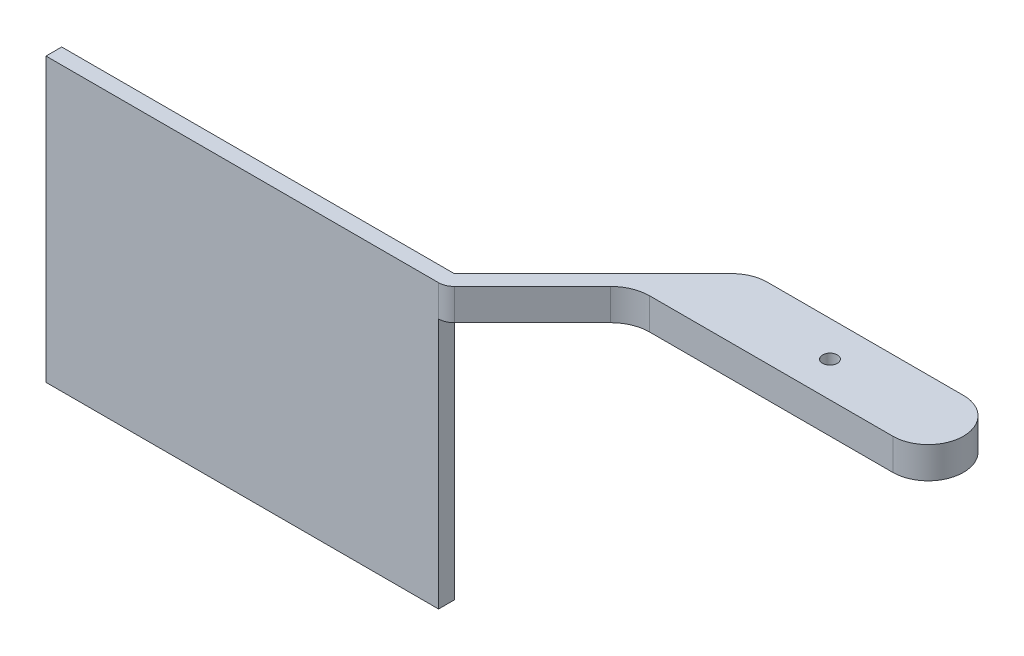
ISO-10303-21;
HEADER;
FILE_DESCRIPTION(('STEP AP214'),'2;1');
FILE_NAME('part.step','',(''),(''),'','','');
FILE_SCHEMA(('AUTOMOTIVE_DESIGN { 1 0 10303 214 1 1 1 1 }'));
ENDSEC;
DATA;
#1=APPLICATION_CONTEXT('core data for automotive mechanical design processes');
#2=APPLICATION_PROTOCOL_DEFINITION('international standard','automotive_design',2000,#1);
#3=PRODUCT_CONTEXT('',#1,'mechanical');
#4=PRODUCT('Part','Part','',(#3));
#5=PRODUCT_RELATED_PRODUCT_CATEGORY('part','',(#4));
#6=PRODUCT_DEFINITION_FORMATION('','',#4);
#7=PRODUCT_DEFINITION_CONTEXT('part definition',#1,'design');
#8=PRODUCT_DEFINITION('design','',#6,#7);
#9=PRODUCT_DEFINITION_SHAPE('','',#8);
#10=(LENGTH_UNIT() NAMED_UNIT(*) SI_UNIT(.MILLI.,.METRE.));
#11=(NAMED_UNIT(*) PLANE_ANGLE_UNIT() SI_UNIT($,.RADIAN.));
#12=(NAMED_UNIT(*) SI_UNIT($,.STERADIAN.) SOLID_ANGLE_UNIT());
#13=UNCERTAINTY_MEASURE_WITH_UNIT(LENGTH_MEASURE(1.E-05),#10,'distance_accuracy_value','');
#14=(GEOMETRIC_REPRESENTATION_CONTEXT(3) GLOBAL_UNCERTAINTY_ASSIGNED_CONTEXT((#13)) GLOBAL_UNIT_ASSIGNED_CONTEXT((#10,
#11,#12)) REPRESENTATION_CONTEXT('',''));
#15=CARTESIAN_POINT('',(0.,0.,0.));
#16=DIRECTION('',(0.,0.,1.));
#17=DIRECTION('',(1.,0.,0.));
#18=AXIS2_PLACEMENT_3D('',#15,#16,#17);
#19=CARTESIAN_POINT('',(0.,-4.,0.));
#20=DIRECTION('',(0.,1.,0.));
#21=DIRECTION('',(0.,0.,1.));
#22=AXIS2_PLACEMENT_3D('',#19,#20,#21);
#23=PLANE('',#22);
#24=DIRECTION('',(-0.707106781186547,0.,0.707106781186548));
#25=VECTOR('',#24,1.);
#26=CARTESIAN_POINT('',(-8.01776695296638,-4.,-8.01776695296637));
#27=LINE('',#26,#25);
#28=CARTESIAN_POINT('',(-22.,-4.,5.96446609406728));
#29=VERTEX_POINT('',#28);
#30=CARTESIAN_POINT('',(-31.9454364826301,-4.,15.9099025766974));
#31=VERTEX_POINT('',#30);
#32=EDGE_CURVE('E275',#29,#31,#27,.T.);
#33=ORIENTED_EDGE('',*,*,#32,.T.);
#34=CARTESIAN_POINT('',(-33.3596500450032,-4.,14.4956890143243));
#35=DIRECTION('',(0.,1.,0.));
#36=DIRECTION('',(0.,0.,1.));
#37=AXIS2_PLACEMENT_3D('',#34,#35,#36);
#38=CIRCLE('',#37,2.);
#39=CARTESIAN_POINT('',(-33.3596500450031,-4.,16.4956890143243));
#40=VERTEX_POINT('',#39);
#41=EDGE_CURVE('E11',#31,#40,#38,.F.);
#42=ORIENTED_EDGE('',*,*,#41,.T.);
#43=DIRECTION('',(0.,0.,1.));
#44=VECTOR('',#43,1.);
#45=CARTESIAN_POINT('',(-33.3596500450031,-4.,14.4956890143243));
#46=LINE('',#45,#44);
#47=CARTESIAN_POINT('',(-33.3596500450031,-4.,14.4956890143243));
#48=VERTEX_POINT('',#47);
#49=EDGE_CURVE('E224',#48,#40,#46,.T.);
#50=ORIENTED_EDGE('',*,*,#49,.F.);
#51=DIRECTION('',(-0.707106781186547,0.,0.707106781186548));
#52=VECTOR('',#51,1.);
#53=CARTESIAN_POINT('',(-9.43198051533949,-4.,-9.43198051533946));
#54=LINE('',#53,#52);
#55=CARTESIAN_POINT('',(-15.6819805153395,-4.,-3.18198051533944));
#56=VERTEX_POINT('',#55);
#57=EDGE_CURVE('E271',#56,#48,#54,.T.);
#58=ORIENTED_EDGE('',*,*,#57,.F.);
#59=CARTESIAN_POINT('',(-12.5,-4.,0.));
#60=DIRECTION('',(0.,1.,0.));
#61=DIRECTION('',(0.,0.,1.));
#62=AXIS2_PLACEMENT_3D('',#59,#60,#61);
#63=CIRCLE('',#62,4.5);
#64=CARTESIAN_POINT('',(-12.5,-4.,-4.5));
#65=VERTEX_POINT('',#64);
#66=EDGE_CURVE('E267',#65,#56,#63,.T.);
#67=ORIENTED_EDGE('',*,*,#66,.F.);
#68=DIRECTION('',(1.,0.,0.));
#69=VECTOR('',#68,1.);
#70=CARTESIAN_POINT('',(0.,-4.,-4.5));
#71=LINE('',#70,#69);
#72=CARTESIAN_POINT('',(12.5,-4.,-4.5));
#73=VERTEX_POINT('',#72);
#74=EDGE_CURVE('E264',#65,#73,#71,.T.);
#75=ORIENTED_EDGE('',*,*,#74,.T.);
#76=CARTESIAN_POINT('',(12.5,-4.,0.));
#77=DIRECTION('',(0.,1.,0.));
#78=DIRECTION('',(0.,0.,1.));
#79=AXIS2_PLACEMENT_3D('',#76,#77,#78);
#80=CIRCLE('',#79,4.5);
#81=CARTESIAN_POINT('',(12.5,-4.,4.49999999999999));
#82=VERTEX_POINT('',#81);
#83=EDGE_CURVE('E260',#82,#73,#80,.T.);
#84=ORIENTED_EDGE('',*,*,#83,.F.);
#85=DIRECTION('',(-1.,0.,0.));
#86=VECTOR('',#85,1.);
#87=CARTESIAN_POINT('',(0.,-4.,4.49999999999998));
#88=LINE('',#87,#86);
#89=CARTESIAN_POINT('',(-18.4644660940672,-4.,4.5));
#90=VERTEX_POINT('',#89);
#91=EDGE_CURVE('E256',#82,#90,#88,.T.);
#92=ORIENTED_EDGE('',*,*,#91,.T.);
#93=CARTESIAN_POINT('',(-18.4644660940672,-4.,9.5));
#94=DIRECTION('',(0.,1.,0.));
#95=DIRECTION('',(0.,0.,1.));
#96=AXIS2_PLACEMENT_3D('',#93,#94,#95);
#97=CIRCLE('',#96,5.);
#98=EDGE_CURVE('E252',#90,#29,#97,.T.);
#99=ORIENTED_EDGE('',*,*,#98,.T.);
#100=EDGE_LOOP('',(#33,#42,#50,#58,#67,#75,#84,#92,#99));
#101=FACE_BOUND('',#100,.T.);
#102=CARTESIAN_POINT('',(-14.05,-4.,0.));
#103=DIRECTION('',(0.,1.,0.));
#104=DIRECTION('',(0.,0.,1.));
#105=AXIS2_PLACEMENT_3D('',#102,#103,#104);
#106=CIRCLE('',#105,2.);
#107=CARTESIAN_POINT('',(-14.05,-4.,-2.));
#108=VERTEX_POINT('',#107);
#109=CARTESIAN_POINT('',(-14.05,-4.,2.));
#110=VERTEX_POINT('',#109);
#111=EDGE_CURVE('E776',#108,#110,#106,.T.);
#112=ORIENTED_EDGE('',*,*,#111,.T.);
#113=DIRECTION('',(0.99849670199507,0.,0.0548118244995302));
#114=VECTOR('',#113,1.);
#115=CARTESIAN_POINT('',(-14.05,-4.,2.));
#116=LINE('',#115,#114);
#117=CARTESIAN_POINT('',(-2.20907220343745,-4.,2.65));
#118=VERTEX_POINT('',#117);
#119=EDGE_CURVE('E206',#110,#118,#116,.T.);
#120=ORIENTED_EDGE('',*,*,#119,.T.);
#121=CARTESIAN_POINT('',(0.,-4.,0.));
#122=DIRECTION('',(0.,1.,0.));
#123=DIRECTION('',(0.,0.,1.));
#124=AXIS2_PLACEMENT_3D('',#121,#122,#123);
#125=CIRCLE('',#124,3.45);
#126=CARTESIAN_POINT('',(2.20907220343746,-4.,2.65));
#127=VERTEX_POINT('',#126);
#128=EDGE_CURVE('E769',#118,#127,#125,.T.);
#129=ORIENTED_EDGE('',*,*,#128,.T.);
#130=DIRECTION('',(0.998496701995071,0.,-0.0548118244995299));
#131=VECTOR('',#130,1.);
#132=CARTESIAN_POINT('',(14.05,-4.,2.));
#133=LINE('',#132,#131);
#134=CARTESIAN_POINT('',(14.05,-4.,2.));
#135=VERTEX_POINT('',#134);
#136=EDGE_CURVE('E745',#127,#135,#133,.T.);
#137=ORIENTED_EDGE('',*,*,#136,.T.);
#138=CARTESIAN_POINT('',(14.05,-4.,0.));
#139=DIRECTION('',(0.,1.,0.));
#140=DIRECTION('',(0.,0.,-1.));
#141=AXIS2_PLACEMENT_3D('',#138,#139,#140);
#142=CIRCLE('',#141,2.);
#143=CARTESIAN_POINT('',(14.05,-4.,-2.));
#144=VERTEX_POINT('',#143);
#145=EDGE_CURVE('E739',#135,#144,#142,.T.);
#146=ORIENTED_EDGE('',*,*,#145,.T.);
#147=DIRECTION('',(-0.998496701995071,0.,-0.05481182449953));
#148=VECTOR('',#147,1.);
#149=CARTESIAN_POINT('',(14.05,-4.,-2.));
#150=LINE('',#149,#148);
#151=CARTESIAN_POINT('',(2.20907220343746,-4.,-2.65));
#152=VERTEX_POINT('',#151);
#153=EDGE_CURVE('E733',#144,#152,#150,.T.);
#154=ORIENTED_EDGE('',*,*,#153,.T.);
#155=CARTESIAN_POINT('',(0.,-4.,0.));
#156=DIRECTION('',(0.,1.,0.));
#157=DIRECTION('',(0.,0.,1.));
#158=AXIS2_PLACEMENT_3D('',#155,#156,#157);
#159=CIRCLE('',#158,3.45);
#160=CARTESIAN_POINT('',(-2.20907220343745,-4.,-2.65));
#161=VERTEX_POINT('',#160);
#162=EDGE_CURVE('E724',#152,#161,#159,.T.);
#163=ORIENTED_EDGE('',*,*,#162,.T.);
#164=DIRECTION('',(-0.99849670199507,0.,0.0548118244995302));
#165=VECTOR('',#164,1.);
#166=CARTESIAN_POINT('',(-14.05,-4.,-2.));
#167=LINE('',#166,#165);
#168=EDGE_CURVE('E202',#161,#108,#167,.T.);
#169=ORIENTED_EDGE('',*,*,#168,.T.);
#170=EDGE_LOOP('',(#112,#120,#129,#137,#146,#154,#163,#169));
#171=FACE_BOUND('',#170,.T.);
#172=ADVANCED_FACE('F44',(#101,#171),#23,.F.);
#173=CARTESIAN_POINT('',(-18.4644660940672,-4.,9.5));
#174=DIRECTION('',(0.,1.,0.));
#175=DIRECTION('',(0.,0.,1.));
#176=AXIS2_PLACEMENT_3D('',#173,#174,#175);
#177=CYLINDRICAL_SURFACE('',#176,5.);
#178=CARTESIAN_POINT('',(-18.4644660940672,0.,9.5));
#179=DIRECTION('',(0.,1.,0.));
#180=DIRECTION('',(0.,0.,1.));
#181=AXIS2_PLACEMENT_3D('',#178,#179,#180);
#182=CIRCLE('',#181,5.);
#183=CARTESIAN_POINT('',(-18.4644660940672,0.,4.5));
#184=VERTEX_POINT('',#183);
#185=CARTESIAN_POINT('',(-22.,0.,5.96446609406728));
#186=VERTEX_POINT('',#185);
#187=EDGE_CURVE('E251',#184,#186,#182,.T.);
#188=ORIENTED_EDGE('',*,*,#187,.T.);
#189=DIRECTION('',(0.,1.,0.));
#190=VECTOR('',#189,1.);
#191=CARTESIAN_POINT('',(-22.,-4.,5.96446609406728));
#192=LINE('',#191,#190);
#193=EDGE_CURVE('E314',#29,#186,#192,.T.);
#194=ORIENTED_EDGE('',*,*,#193,.F.);
#195=ORIENTED_EDGE('',*,*,#98,.F.);
#196=DIRECTION('',(0.,1.,0.));
#197=VECTOR('',#196,1.);
#198=CARTESIAN_POINT('',(-18.4644660940672,-4.,4.5));
#199=LINE('',#198,#197);
#200=EDGE_CURVE('E278',#90,#184,#199,.T.);
#201=ORIENTED_EDGE('',*,*,#200,.T.);
#202=EDGE_LOOP('',(#188,#194,#195,#201));
#203=FACE_BOUND('',#202,.T.);
#204=ADVANCED_FACE('F437',(#203),#177,.F.);
#205=CARTESIAN_POINT('',(-8.01776695296638,-4.,-8.01776695296637));
#206=DIRECTION('',(-0.707106781186548,0.,-0.707106781186547));
#207=DIRECTION('',(-0.707106781186547,0.,0.707106781186548));
#208=AXIS2_PLACEMENT_3D('',#205,#206,#207);
#209=PLANE('',#208);
#210=DIRECTION('',(-0.707106781186547,0.,0.707106781186548));
#211=VECTOR('',#210,1.);
#212=CARTESIAN_POINT('',(-8.01776695296638,0.,-8.01776695296637));
#213=LINE('',#212,#211);
#214=CARTESIAN_POINT('',(-31.9454364826301,0.,15.9099025766974));
#215=VERTEX_POINT('',#214);
#216=EDGE_CURVE('E257',#186,#215,#213,.T.);
#217=ORIENTED_EDGE('',*,*,#216,.T.);
#218=DIRECTION('',(0.,1.,0.));
#219=VECTOR('',#218,1.);
#220=CARTESIAN_POINT('',(-31.9454364826301,-4.,15.9099025766974));
#221=LINE('',#220,#219);
#222=EDGE_CURVE('E53',#215,#31,#221,.F.);
#223=ORIENTED_EDGE('',*,*,#222,.T.);
#224=ORIENTED_EDGE('',*,*,#32,.F.);
#225=ORIENTED_EDGE('',*,*,#193,.T.);
#226=EDGE_LOOP('',(#217,#223,#224,#225));
#227=FACE_BOUND('',#226,.T.);
#228=ADVANCED_FACE('F439',(#227),#209,.F.);
#229=CARTESIAN_POINT('',(0.,-4.,16.4956890143243));
#230=DIRECTION('',(0.,0.,1.));
#231=DIRECTION('',(1.,0.,0.));
#232=AXIS2_PLACEMENT_3D('',#229,#230,#231);
#233=PLANE('',#232);
#234=DIRECTION('',(0.,1.,0.));
#235=VECTOR('',#234,1.);
#236=CARTESIAN_POINT('',(-33.3596500450031,-36.,16.4956890143243));
#237=LINE('',#236,#235);
#238=CARTESIAN_POINT('',(-33.3596500450031,-36.,16.4956890143243));
#239=VERTEX_POINT('',#238);
#240=EDGE_CURVE('E247',#239,#40,#237,.T.);
#241=ORIENTED_EDGE('',*,*,#240,.T.);
#242=DIRECTION('',(0.,1.,0.));
#243=VECTOR('',#242,1.);
#244=CARTESIAN_POINT('',(-33.3596500450032,0.,16.4956890143243));
#245=LINE('',#244,#243);
#246=CARTESIAN_POINT('',(-33.3596500450032,0.,16.4956890143243));
#247=VERTEX_POINT('',#246);
#248=EDGE_CURVE('E318',#40,#247,#245,.T.);
#249=ORIENTED_EDGE('',*,*,#248,.T.);
#250=DIRECTION('',(1.,0.,0.));
#251=VECTOR('',#250,1.);
#252=CARTESIAN_POINT('',(0.,0.,16.4956890143243));
#253=LINE('',#252,#251);
#254=CARTESIAN_POINT('',(-83.3596500450032,0.,16.4956890143243));
#255=VERTEX_POINT('',#254);
#256=EDGE_CURVE('E309',#255,#247,#253,.T.);
#257=ORIENTED_EDGE('',*,*,#256,.F.);
#258=DIRECTION('',(0.,1.,0.));
#259=VECTOR('',#258,1.);
#260=CARTESIAN_POINT('',(-83.3596500450032,-4.,16.4956890143243));
#261=LINE('',#260,#259);
#262=CARTESIAN_POINT('',(-83.3596500450032,-36.,16.4956890143243));
#263=VERTEX_POINT('',#262);
#264=EDGE_CURVE('E319',#263,#255,#261,.T.);
#265=ORIENTED_EDGE('',*,*,#264,.F.);
#266=DIRECTION('',(-1.,0.,0.));
#267=VECTOR('',#266,1.);
#268=CARTESIAN_POINT('',(-33.3596500450031,-36.,16.4956890143243));
#269=LINE('',#268,#267);
#270=EDGE_CURVE('E229',#239,#263,#269,.T.);
#271=ORIENTED_EDGE('',*,*,#270,.F.);
#272=EDGE_LOOP('',(#241,#249,#257,#265,#271));
#273=FACE_BOUND('',#272,.T.);
#274=ADVANCED_FACE('F390',(#273),#233,.T.);
#275=CARTESIAN_POINT('',(-83.3596500450032,-4.,0.));
#276=DIRECTION('',(-1.,0.,0.));
#277=DIRECTION('',(0.,0.,1.));
#278=AXIS2_PLACEMENT_3D('',#275,#276,#277);
#279=PLANE('',#278);
#280=DIRECTION('',(0.,0.,1.));
#281=VECTOR('',#280,1.);
#282=CARTESIAN_POINT('',(-83.3596500450032,0.,0.));
#283=LINE('',#282,#281);
#284=CARTESIAN_POINT('',(-83.3596500450032,0.,14.4956890143243));
#285=VERTEX_POINT('',#284);
#286=EDGE_CURVE('E305',#285,#255,#283,.T.);
#287=ORIENTED_EDGE('',*,*,#286,.F.);
#288=DIRECTION('',(0.,1.,0.));
#289=VECTOR('',#288,1.);
#290=CARTESIAN_POINT('',(-83.3596500450032,-4.,14.4956890143243));
#291=LINE('',#290,#289);
#292=CARTESIAN_POINT('',(-83.3596500450032,-36.,14.4956890143243));
#293=VERTEX_POINT('',#292);
#294=EDGE_CURVE('E322',#293,#285,#291,.T.);
#295=ORIENTED_EDGE('',*,*,#294,.F.);
#296=DIRECTION('',(0.,0.,-1.));
#297=VECTOR('',#296,1.);
#298=CARTESIAN_POINT('',(-83.3596500450032,-36.,14.4956890143243));
#299=LINE('',#298,#297);
#300=EDGE_CURVE('E233',#263,#293,#299,.T.);
#301=ORIENTED_EDGE('',*,*,#300,.F.);
#302=ORIENTED_EDGE('',*,*,#264,.T.);
#303=EDGE_LOOP('',(#287,#295,#301,#302));
#304=FACE_BOUND('',#303,.T.);
#305=ADVANCED_FACE('F398',(#304),#279,.T.);
#306=CARTESIAN_POINT('',(0.,-4.,14.4956890143243));
#307=DIRECTION('',(0.,0.,1.));
#308=DIRECTION('',(1.,0.,0.));
#309=AXIS2_PLACEMENT_3D('',#306,#307,#308);
#310=PLANE('',#309);
#311=DIRECTION('',(1.,0.,0.));
#312=VECTOR('',#311,1.);
#313=CARTESIAN_POINT('',(0.,0.,14.4956890143243));
#314=LINE('',#313,#312);
#315=CARTESIAN_POINT('',(-33.3596500450031,0.,14.4956890143243));
#316=VERTEX_POINT('',#315);
#317=EDGE_CURVE('E301',#285,#316,#314,.T.);
#318=ORIENTED_EDGE('',*,*,#317,.T.);
#319=DIRECTION('',(0.,1.,0.));
#320=VECTOR('',#319,1.);
#321=CARTESIAN_POINT('',(-33.3596500450031,-4.,14.4956890143243));
#322=LINE('',#321,#320);
#323=EDGE_CURVE('E325',#48,#316,#322,.T.);
#324=ORIENTED_EDGE('',*,*,#323,.F.);
#325=DIRECTION('',(0.,1.,0.));
#326=VECTOR('',#325,1.);
#327=CARTESIAN_POINT('',(-33.3596500450031,-36.,14.4956890143243));
#328=LINE('',#327,#326);
#329=CARTESIAN_POINT('',(-33.3596500450031,-36.,14.4956890143243));
#330=VERTEX_POINT('',#329);
#331=EDGE_CURVE('E240',#330,#48,#328,.T.);
#332=ORIENTED_EDGE('',*,*,#331,.F.);
#333=DIRECTION('',(1.,0.,0.));
#334=VECTOR('',#333,1.);
#335=CARTESIAN_POINT('',(-33.3596500450031,-36.,14.4956890143243));
#336=LINE('',#335,#334);
#337=EDGE_CURVE('E237',#293,#330,#336,.T.);
#338=ORIENTED_EDGE('',*,*,#337,.F.);
#339=ORIENTED_EDGE('',*,*,#294,.T.);
#340=EDGE_LOOP('',(#318,#324,#332,#338,#339));
#341=FACE_BOUND('',#340,.T.);
#342=ADVANCED_FACE('F413',(#341),#310,.F.);
#343=CARTESIAN_POINT('',(-9.43198051533949,-4.,-9.43198051533946));
#344=DIRECTION('',(-0.707106781186548,0.,-0.707106781186547));
#345=DIRECTION('',(-0.707106781186547,0.,0.707106781186548));
#346=AXIS2_PLACEMENT_3D('',#343,#344,#345);
#347=PLANE('',#346);
#348=DIRECTION('',(-0.707106781186547,0.,0.707106781186548));
#349=VECTOR('',#348,1.);
#350=CARTESIAN_POINT('',(-9.43198051533949,0.,-9.43198051533946));
#351=LINE('',#350,#349);
#352=CARTESIAN_POINT('',(-15.6819805153395,0.,-3.18198051533944));
#353=VERTEX_POINT('',#352);
#354=EDGE_CURVE('E297',#353,#316,#351,.T.);
#355=ORIENTED_EDGE('',*,*,#354,.F.);
#356=DIRECTION('',(0.,1.,0.));
#357=VECTOR('',#356,1.);
#358=CARTESIAN_POINT('',(-15.6819805153395,-4.,-3.18198051533944));
#359=LINE('',#358,#357);
#360=EDGE_CURVE('E328',#56,#353,#359,.T.);
#361=ORIENTED_EDGE('',*,*,#360,.F.);
#362=ORIENTED_EDGE('',*,*,#57,.T.);
#363=ORIENTED_EDGE('',*,*,#323,.T.);
#364=EDGE_LOOP('',(#355,#361,#362,#363));
#365=FACE_BOUND('',#364,.T.);
#366=ADVANCED_FACE('F416',(#365),#347,.T.);
#367=CARTESIAN_POINT('',(-12.5,-4.,0.));
#368=DIRECTION('',(0.,1.,0.));
#369=DIRECTION('',(0.,0.,1.));
#370=AXIS2_PLACEMENT_3D('',#367,#368,#369);
#371=CYLINDRICAL_SURFACE('',#370,4.5);
#372=CARTESIAN_POINT('',(-12.5,0.,0.));
#373=DIRECTION('',(0.,1.,0.));
#374=DIRECTION('',(0.,0.,1.));
#375=AXIS2_PLACEMENT_3D('',#372,#373,#374);
#376=CIRCLE('',#375,4.5);
#377=CARTESIAN_POINT('',(-12.5,0.,-4.5));
#378=VERTEX_POINT('',#377);
#379=EDGE_CURVE('E293',#378,#353,#376,.T.);
#380=ORIENTED_EDGE('',*,*,#379,.F.);
#381=DIRECTION('',(0.,1.,0.));
#382=VECTOR('',#381,1.);
#383=CARTESIAN_POINT('',(-12.5,-4.,-4.5));
#384=LINE('',#383,#382);
#385=EDGE_CURVE('E331',#65,#378,#384,.T.);
#386=ORIENTED_EDGE('',*,*,#385,.F.);
#387=ORIENTED_EDGE('',*,*,#66,.T.);
#388=ORIENTED_EDGE('',*,*,#360,.T.);
#389=EDGE_LOOP('',(#380,#386,#387,#388));
#390=FACE_BOUND('',#389,.T.);
#391=ADVANCED_FACE('F419',(#390),#371,.T.);
#392=CARTESIAN_POINT('',(0.,-4.,-4.5));
#393=DIRECTION('',(0.,0.,1.));
#394=DIRECTION('',(1.,0.,0.));
#395=AXIS2_PLACEMENT_3D('',#392,#393,#394);
#396=PLANE('',#395);
#397=DIRECTION('',(1.,0.,0.));
#398=VECTOR('',#397,1.);
#399=CARTESIAN_POINT('',(0.,0.,-4.5));
#400=LINE('',#399,#398);
#401=CARTESIAN_POINT('',(12.5,0.,-4.5));
#402=VERTEX_POINT('',#401);
#403=EDGE_CURVE('E289',#378,#402,#400,.T.);
#404=ORIENTED_EDGE('',*,*,#403,.T.);
#405=DIRECTION('',(0.,1.,0.));
#406=VECTOR('',#405,1.);
#407=CARTESIAN_POINT('',(12.5,-4.,-4.5));
#408=LINE('',#407,#406);
#409=EDGE_CURVE('E334',#73,#402,#408,.T.);
#410=ORIENTED_EDGE('',*,*,#409,.F.);
#411=ORIENTED_EDGE('',*,*,#74,.F.);
#412=ORIENTED_EDGE('',*,*,#385,.T.);
#413=EDGE_LOOP('',(#404,#410,#411,#412));
#414=FACE_BOUND('',#413,.T.);
#415=ADVANCED_FACE('F424',(#414),#396,.F.);
#416=CARTESIAN_POINT('',(12.5,-4.,0.));
#417=DIRECTION('',(0.,1.,0.));
#418=DIRECTION('',(0.,0.,1.));
#419=AXIS2_PLACEMENT_3D('',#416,#417,#418);
#420=CYLINDRICAL_SURFACE('',#419,4.5);
#421=CARTESIAN_POINT('',(12.5,0.,0.));
#422=DIRECTION('',(0.,1.,0.));
#423=DIRECTION('',(0.,0.,1.));
#424=AXIS2_PLACEMENT_3D('',#421,#422,#423);
#425=CIRCLE('',#424,4.5);
#426=CARTESIAN_POINT('',(12.5,0.,4.49999999999999));
#427=VERTEX_POINT('',#426);
#428=EDGE_CURVE('E285',#427,#402,#425,.T.);
#429=ORIENTED_EDGE('',*,*,#428,.F.);
#430=DIRECTION('',(0.,1.,0.));
#431=VECTOR('',#430,1.);
#432=CARTESIAN_POINT('',(12.5,-4.,4.49999999999999));
#433=LINE('',#432,#431);
#434=EDGE_CURVE('E337',#82,#427,#433,.T.);
#435=ORIENTED_EDGE('',*,*,#434,.F.);
#436=ORIENTED_EDGE('',*,*,#83,.T.);
#437=ORIENTED_EDGE('',*,*,#409,.T.);
#438=EDGE_LOOP('',(#429,#435,#436,#437));
#439=FACE_BOUND('',#438,.T.);
#440=ADVANCED_FACE('F428',(#439),#420,.T.);
#441=CARTESIAN_POINT('',(0.,-4.,4.49999999999998));
#442=DIRECTION('',(0.,0.,-1.));
#443=DIRECTION('',(-1.,0.,0.));
#444=AXIS2_PLACEMENT_3D('',#441,#442,#443);
#445=PLANE('',#444);
#446=DIRECTION('',(-1.,0.,0.));
#447=VECTOR('',#446,1.);
#448=CARTESIAN_POINT('',(0.,0.,4.49999999999998));
#449=LINE('',#448,#447);
#450=EDGE_CURVE('E282',#427,#184,#449,.T.);
#451=ORIENTED_EDGE('',*,*,#450,.T.);
#452=ORIENTED_EDGE('',*,*,#200,.F.);
#453=ORIENTED_EDGE('',*,*,#91,.F.);
#454=ORIENTED_EDGE('',*,*,#434,.T.);
#455=EDGE_LOOP('',(#451,#452,#453,#454));
#456=FACE_BOUND('',#455,.T.);
#457=ADVANCED_FACE('F433',(#456),#445,.F.);
#458=CARTESIAN_POINT('',(0.,0.,0.));
#459=DIRECTION('',(0.,1.,0.));
#460=DIRECTION('',(0.,0.,1.));
#461=AXIS2_PLACEMENT_3D('',#458,#459,#460);
#462=PLANE('',#461);
#463=CARTESIAN_POINT('',(0.,0.,0.));
#464=DIRECTION('',(0.,1.,0.));
#465=DIRECTION('',(0.,0.,1.));
#466=AXIS2_PLACEMENT_3D('',#463,#464,#465);
#467=CIRCLE('',#466,0.94);
#468=CARTESIAN_POINT('',(0.,0.,0.940000000000002));
#469=VERTEX_POINT('',#468);
#470=EDGE_CURVE('E215',#469,#469,#467,.T.);
#471=ORIENTED_EDGE('',*,*,#470,.F.);
#472=EDGE_LOOP('',(#471));
#473=FACE_BOUND('',#472,.T.);
#474=ORIENTED_EDGE('',*,*,#256,.T.);
#475=CARTESIAN_POINT('',(-33.3596500450032,0.,14.4956890143243));
#476=DIRECTION('',(0.,1.,0.));
#477=DIRECTION('',(0.,0.,1.));
#478=AXIS2_PLACEMENT_3D('',#475,#476,#477);
#479=CIRCLE('',#478,2.);
#480=EDGE_CURVE('E67',#247,#215,#479,.T.);
#481=ORIENTED_EDGE('',*,*,#480,.T.);
#482=ORIENTED_EDGE('',*,*,#216,.F.);
#483=ORIENTED_EDGE('',*,*,#187,.F.);
#484=ORIENTED_EDGE('',*,*,#450,.F.);
#485=ORIENTED_EDGE('',*,*,#428,.T.);
#486=ORIENTED_EDGE('',*,*,#403,.F.);
#487=ORIENTED_EDGE('',*,*,#379,.T.);
#488=ORIENTED_EDGE('',*,*,#354,.T.);
#489=ORIENTED_EDGE('',*,*,#317,.F.);
#490=ORIENTED_EDGE('',*,*,#286,.T.);
#491=EDGE_LOOP('',(#474,#481,#482,#483,#484,#485,#486,#487,#488,#489,#490));
#492=FACE_BOUND('',#491,.T.);
#493=ADVANCED_FACE('F394',(#473,#492),#462,.T.);
#494=CARTESIAN_POINT('',(-33.3596500450031,-36.,14.4956890143243));
#495=DIRECTION('',(-1.,0.,0.));
#496=DIRECTION('',(0.,0.,1.));
#497=AXIS2_PLACEMENT_3D('',#494,#495,#496);
#498=PLANE('',#497);
#499=ORIENTED_EDGE('',*,*,#49,.T.);
#500=ORIENTED_EDGE('',*,*,#240,.F.);
#501=DIRECTION('',(0.,0.,1.));
#502=VECTOR('',#501,1.);
#503=CARTESIAN_POINT('',(-33.3596500450031,-36.,14.4956890143243));
#504=LINE('',#503,#502);
#505=EDGE_CURVE('E225',#330,#239,#504,.T.);
#506=ORIENTED_EDGE('',*,*,#505,.F.);
#507=ORIENTED_EDGE('',*,*,#331,.T.);
#508=EDGE_LOOP('',(#499,#500,#506,#507));
#509=FACE_BOUND('',#508,.T.);
#510=ADVANCED_FACE('F406',(#509),#498,.F.);
#511=CARTESIAN_POINT('',(0.,-36.,0.));
#512=DIRECTION('',(0.,-1.,0.));
#513=DIRECTION('',(0.,0.,-1.));
#514=AXIS2_PLACEMENT_3D('',#511,#512,#513);
#515=PLANE('',#514);
#516=ORIENTED_EDGE('',*,*,#505,.T.);
#517=ORIENTED_EDGE('',*,*,#270,.T.);
#518=ORIENTED_EDGE('',*,*,#300,.T.);
#519=ORIENTED_EDGE('',*,*,#337,.T.);
#520=EDGE_LOOP('',(#516,#517,#518,#519));
#521=FACE_BOUND('',#520,.T.);
#522=ADVANCED_FACE('F401',(#521),#515,.T.);
#523=CARTESIAN_POINT('',(0.,-36.,0.));
#524=DIRECTION('',(0.,1.,0.));
#525=DIRECTION('',(0.,0.,1.));
#526=AXIS2_PLACEMENT_3D('',#523,#524,#525);
#527=CYLINDRICAL_SURFACE('',#526,0.94);
#528=CARTESIAN_POINT('',(0.,-2.,0.));
#529=DIRECTION('',(0.,1.,0.));
#530=DIRECTION('',(0.,0.,1.));
#531=AXIS2_PLACEMENT_3D('',#528,#529,#530);
#532=CIRCLE('',#531,0.94);
#533=CARTESIAN_POINT('',(0.,-2.,0.940000000000002));
#534=VERTEX_POINT('',#533);
#535=EDGE_CURVE('E208',#534,#534,#532,.F.);
#536=ORIENTED_EDGE('',*,*,#535,.T.);
#537=EDGE_LOOP('',(#536));
#538=FACE_BOUND('',#537,.T.);
#539=ORIENTED_EDGE('',*,*,#470,.T.);
#540=EDGE_LOOP('',(#539));
#541=FACE_BOUND('',#540,.T.);
#542=ADVANCED_FACE('F497',(#538,#541),#527,.F.);
#543=CARTESIAN_POINT('',(-14.05,-2.,0.));
#544=DIRECTION('',(0.,1.,0.));
#545=DIRECTION('',(0.,0.,1.));
#546=AXIS2_PLACEMENT_3D('',#543,#544,#545);
#547=PLANE('',#546);
#548=CARTESIAN_POINT('',(-14.05,-2.,0.));
#549=DIRECTION('',(0.,1.,0.));
#550=DIRECTION('',(0.,0.,1.));
#551=AXIS2_PLACEMENT_3D('',#548,#549,#550);
#552=CIRCLE('',#551,2.);
#553=CARTESIAN_POINT('',(-14.05,-2.,-2.));
#554=VERTEX_POINT('',#553);
#555=CARTESIAN_POINT('',(-14.05,-2.,2.));
#556=VERTEX_POINT('',#555);
#557=EDGE_CURVE('E185',#554,#556,#552,.T.);
#558=ORIENTED_EDGE('',*,*,#557,.F.);
#559=DIRECTION('',(-0.99849670199507,0.,0.0548118244995302));
#560=VECTOR('',#559,1.);
#561=CARTESIAN_POINT('',(-14.05,-2.,-2.));
#562=LINE('',#561,#560);
#563=CARTESIAN_POINT('',(-2.20907220343745,-2.,-2.65));
#564=VERTEX_POINT('',#563);
#565=EDGE_CURVE('E753',#564,#554,#562,.T.);
#566=ORIENTED_EDGE('',*,*,#565,.F.);
#567=CARTESIAN_POINT('',(0.,-2.,0.));
#568=DIRECTION('',(0.,1.,0.));
#569=DIRECTION('',(0.,0.,1.));
#570=AXIS2_PLACEMENT_3D('',#567,#568,#569);
#571=CIRCLE('',#570,3.45);
#572=CARTESIAN_POINT('',(2.20907220343746,-2.,-2.65));
#573=VERTEX_POINT('',#572);
#574=EDGE_CURVE('E783',#573,#564,#571,.T.);
#575=ORIENTED_EDGE('',*,*,#574,.F.);
#576=DIRECTION('',(-0.998496701995071,0.,-0.05481182449953));
#577=VECTOR('',#576,1.);
#578=CARTESIAN_POINT('',(14.05,-2.,-2.));
#579=LINE('',#578,#577);
#580=CARTESIAN_POINT('',(14.05,-2.,-2.));
#581=VERTEX_POINT('',#580);
#582=EDGE_CURVE('E786',#581,#573,#579,.T.);
#583=ORIENTED_EDGE('',*,*,#582,.F.);
#584=CARTESIAN_POINT('',(14.05,-2.,0.));
#585=DIRECTION('',(0.,1.,0.));
#586=DIRECTION('',(0.,0.,-1.));
#587=AXIS2_PLACEMENT_3D('',#584,#585,#586);
#588=CIRCLE('',#587,2.);
#589=CARTESIAN_POINT('',(14.05,-2.,2.));
#590=VERTEX_POINT('',#589);
#591=EDGE_CURVE('E789',#590,#581,#588,.T.);
#592=ORIENTED_EDGE('',*,*,#591,.F.);
#593=DIRECTION('',(0.998496701995071,0.,-0.0548118244995299));
#594=VECTOR('',#593,1.);
#595=CARTESIAN_POINT('',(14.05,-2.,2.));
#596=LINE('',#595,#594);
#597=CARTESIAN_POINT('',(2.20907220343746,-2.,2.65));
#598=VERTEX_POINT('',#597);
#599=EDGE_CURVE('E792',#598,#590,#596,.T.);
#600=ORIENTED_EDGE('',*,*,#599,.F.);
#601=CARTESIAN_POINT('',(0.,-2.,0.));
#602=DIRECTION('',(0.,1.,0.));
#603=DIRECTION('',(0.,0.,1.));
#604=AXIS2_PLACEMENT_3D('',#601,#602,#603);
#605=CIRCLE('',#604,3.45);
#606=CARTESIAN_POINT('',(-2.20907220343745,-2.,2.65));
#607=VERTEX_POINT('',#606);
#608=EDGE_CURVE('E187',#607,#598,#605,.T.);
#609=ORIENTED_EDGE('',*,*,#608,.F.);
#610=DIRECTION('',(0.99849670199507,0.,0.0548118244995302));
#611=VECTOR('',#610,1.);
#612=CARTESIAN_POINT('',(-14.05,-2.,2.));
#613=LINE('',#612,#611);
#614=EDGE_CURVE('E180',#556,#607,#613,.T.);
#615=ORIENTED_EDGE('',*,*,#614,.F.);
#616=EDGE_LOOP('',(#558,#566,#575,#583,#592,#600,#609,#615));
#617=FACE_BOUND('',#616,.T.);
#618=ORIENTED_EDGE('',*,*,#535,.F.);
#619=EDGE_LOOP('',(#618));
#620=FACE_BOUND('',#619,.T.);
#621=ADVANCED_FACE('F182',(#617,#620),#547,.F.);
#622=CARTESIAN_POINT('',(-14.05,-2.,0.));
#623=DIRECTION('',(0.,-1.,0.));
#624=DIRECTION('',(0.,0.,-1.));
#625=AXIS2_PLACEMENT_3D('',#622,#623,#624);
#626=CYLINDRICAL_SURFACE('',#625,2.);
#627=ORIENTED_EDGE('',*,*,#111,.F.);
#628=DIRECTION('',(0.,-1.,0.));
#629=VECTOR('',#628,1.);
#630=CARTESIAN_POINT('',(-14.05,-2.,-2.));
#631=LINE('',#630,#629);
#632=EDGE_CURVE('E200',#554,#108,#631,.T.);
#633=ORIENTED_EDGE('',*,*,#632,.F.);
#634=ORIENTED_EDGE('',*,*,#557,.T.);
#635=DIRECTION('',(0.,-1.,0.));
#636=VECTOR('',#635,1.);
#637=CARTESIAN_POINT('',(-14.05,-2.,2.));
#638=LINE('',#637,#636);
#639=EDGE_CURVE('E197',#556,#110,#638,.T.);
#640=ORIENTED_EDGE('',*,*,#639,.T.);
#641=EDGE_LOOP('',(#627,#633,#634,#640));
#642=FACE_BOUND('',#641,.T.);
#643=ADVANCED_FACE('F196',(#642),#626,.F.);
#644=CARTESIAN_POINT('',(-14.05,-2.,2.));
#645=DIRECTION('',(0.0548118244995302,0.,-0.998496701995071));
#646=DIRECTION('',(-0.998496701995071,0.,-0.0548118244995302));
#647=AXIS2_PLACEMENT_3D('',#644,#645,#646);
#648=PLANE('',#647);
#649=ORIENTED_EDGE('',*,*,#119,.F.);
#650=ORIENTED_EDGE('',*,*,#639,.F.);
#651=ORIENTED_EDGE('',*,*,#614,.T.);
#652=DIRECTION('',(0.,-1.,0.));
#653=VECTOR('',#652,1.);
#654=CARTESIAN_POINT('',(-2.20907220343745,-2.,2.65));
#655=LINE('',#654,#653);
#656=EDGE_CURVE('E209',#607,#118,#655,.T.);
#657=ORIENTED_EDGE('',*,*,#656,.T.);
#658=EDGE_LOOP('',(#649,#650,#651,#657));
#659=FACE_BOUND('',#658,.T.);
#660=ADVANCED_FACE('F204',(#659),#648,.T.);
#661=CARTESIAN_POINT('',(0.,-2.,0.));
#662=DIRECTION('',(0.,-1.,0.));
#663=DIRECTION('',(0.,0.,-1.));
#664=AXIS2_PLACEMENT_3D('',#661,#662,#663);
#665=CYLINDRICAL_SURFACE('',#664,3.45);
#666=ORIENTED_EDGE('',*,*,#128,.F.);
#667=ORIENTED_EDGE('',*,*,#656,.F.);
#668=ORIENTED_EDGE('',*,*,#608,.T.);
#669=DIRECTION('',(0.,-1.,0.));
#670=VECTOR('',#669,1.);
#671=CARTESIAN_POINT('',(2.20907220343746,-2.,2.65));
#672=LINE('',#671,#670);
#673=EDGE_CURVE('E217',#598,#127,#672,.T.);
#674=ORIENTED_EDGE('',*,*,#673,.T.);
#675=EDGE_LOOP('',(#666,#667,#668,#674));
#676=FACE_BOUND('',#675,.T.);
#677=ADVANCED_FACE('F523',(#676),#665,.F.);
#678=CARTESIAN_POINT('',(14.05,-2.,2.));
#679=DIRECTION('',(-0.0548118244995299,0.,-0.998496701995071));
#680=DIRECTION('',(-0.998496701995071,0.,0.0548118244995299));
#681=AXIS2_PLACEMENT_3D('',#678,#679,#680);
#682=PLANE('',#681);
#683=ORIENTED_EDGE('',*,*,#136,.F.);
#684=ORIENTED_EDGE('',*,*,#673,.F.);
#685=ORIENTED_EDGE('',*,*,#599,.T.);
#686=DIRECTION('',(0.,-1.,0.));
#687=VECTOR('',#686,1.);
#688=CARTESIAN_POINT('',(14.05,-2.,2.));
#689=LINE('',#688,#687);
#690=EDGE_CURVE('E761',#590,#135,#689,.T.);
#691=ORIENTED_EDGE('',*,*,#690,.T.);
#692=EDGE_LOOP('',(#683,#684,#685,#691));
#693=FACE_BOUND('',#692,.T.);
#694=ADVANCED_FACE('F530',(#693),#682,.T.);
#695=CARTESIAN_POINT('',(14.05,-2.,0.));
#696=DIRECTION('',(0.,-1.,0.));
#697=DIRECTION('',(0.,0.,-1.));
#698=AXIS2_PLACEMENT_3D('',#695,#696,#697);
#699=CYLINDRICAL_SURFACE('',#698,2.);
#700=ORIENTED_EDGE('',*,*,#145,.F.);
#701=ORIENTED_EDGE('',*,*,#690,.F.);
#702=ORIENTED_EDGE('',*,*,#591,.T.);
#703=DIRECTION('',(0.,-1.,0.));
#704=VECTOR('',#703,1.);
#705=CARTESIAN_POINT('',(14.05,-2.,-2.));
#706=LINE('',#705,#704);
#707=EDGE_CURVE('E758',#581,#144,#706,.T.);
#708=ORIENTED_EDGE('',*,*,#707,.T.);
#709=EDGE_LOOP('',(#700,#701,#702,#708));
#710=FACE_BOUND('',#709,.T.);
#711=ADVANCED_FACE('F538',(#710),#699,.F.);
#712=CARTESIAN_POINT('',(14.05,-2.,-2.));
#713=DIRECTION('',(-0.05481182449953,0.,0.998496701995071));
#714=DIRECTION('',(0.998496701995071,0.,0.05481182449953));
#715=AXIS2_PLACEMENT_3D('',#712,#713,#714);
#716=PLANE('',#715);
#717=ORIENTED_EDGE('',*,*,#153,.F.);
#718=ORIENTED_EDGE('',*,*,#707,.F.);
#719=ORIENTED_EDGE('',*,*,#582,.T.);
#720=DIRECTION('',(0.,-1.,0.));
#721=VECTOR('',#720,1.);
#722=CARTESIAN_POINT('',(2.20907220343746,-2.,-2.65));
#723=LINE('',#722,#721);
#724=EDGE_CURVE('E726',#573,#152,#723,.T.);
#725=ORIENTED_EDGE('',*,*,#724,.T.);
#726=EDGE_LOOP('',(#717,#718,#719,#725));
#727=FACE_BOUND('',#726,.T.);
#728=ADVANCED_FACE('F546',(#727),#716,.T.);
#729=CARTESIAN_POINT('',(0.,-2.,0.));
#730=DIRECTION('',(0.,-1.,0.));
#731=DIRECTION('',(0.,0.,-1.));
#732=AXIS2_PLACEMENT_3D('',#729,#730,#731);
#733=CYLINDRICAL_SURFACE('',#732,3.45);
#734=ORIENTED_EDGE('',*,*,#162,.F.);
#735=ORIENTED_EDGE('',*,*,#724,.F.);
#736=ORIENTED_EDGE('',*,*,#574,.T.);
#737=DIRECTION('',(0.,-1.,0.));
#738=VECTOR('',#737,1.);
#739=CARTESIAN_POINT('',(-2.20907220343745,-2.,-2.65));
#740=LINE('',#739,#738);
#741=EDGE_CURVE('E729',#564,#161,#740,.T.);
#742=ORIENTED_EDGE('',*,*,#741,.T.);
#743=EDGE_LOOP('',(#734,#735,#736,#742));
#744=FACE_BOUND('',#743,.T.);
#745=ADVANCED_FACE('F445',(#744),#733,.F.);
#746=CARTESIAN_POINT('',(-14.05,-2.,-2.));
#747=DIRECTION('',(0.0548118244995302,0.,0.998496701995071));
#748=DIRECTION('',(0.998496701995071,0.,-0.0548118244995302));
#749=AXIS2_PLACEMENT_3D('',#746,#747,#748);
#750=PLANE('',#749);
#751=ORIENTED_EDGE('',*,*,#168,.F.);
#752=ORIENTED_EDGE('',*,*,#741,.F.);
#753=ORIENTED_EDGE('',*,*,#565,.T.);
#754=ORIENTED_EDGE('',*,*,#632,.T.);
#755=EDGE_LOOP('',(#751,#752,#753,#754));
#756=FACE_BOUND('',#755,.T.);
#757=ADVANCED_FACE('F441',(#756),#750,.T.);
#758=CARTESIAN_POINT('',(-33.3596500450032,-4.,14.4956890143243));
#759=DIRECTION('',(0.,-1.,0.));
#760=DIRECTION('',(0.,0.,-1.));
#761=AXIS2_PLACEMENT_3D('',#758,#759,#760);
#762=CYLINDRICAL_SURFACE('',#761,2.);
#763=ORIENTED_EDGE('',*,*,#41,.F.);
#764=ORIENTED_EDGE('',*,*,#222,.F.);
#765=ORIENTED_EDGE('',*,*,#480,.F.);
#766=ORIENTED_EDGE('',*,*,#248,.F.);
#767=EDGE_LOOP('',(#763,#764,#765,#766));
#768=FACE_BOUND('',#767,.T.);
#769=ADVANCED_FACE('F46',(#768),#762,.T.);
#770=CLOSED_SHELL('',(#172,#204,#228,#274,#305,#342,#366,#391,#415,#440,#457,#493,#510,#522,
#542,#621,#643,#660,#677,#694,#711,#728,#745,#757,#769));
#771=MANIFOLD_SOLID_BREP('B2',#770);
#772=ADVANCED_BREP_SHAPE_REPRESENTATION('',(#18,#771),#14);
#773=SHAPE_DEFINITION_REPRESENTATION(#9,#772);
ENDSEC;
END-ISO-10303-21;
